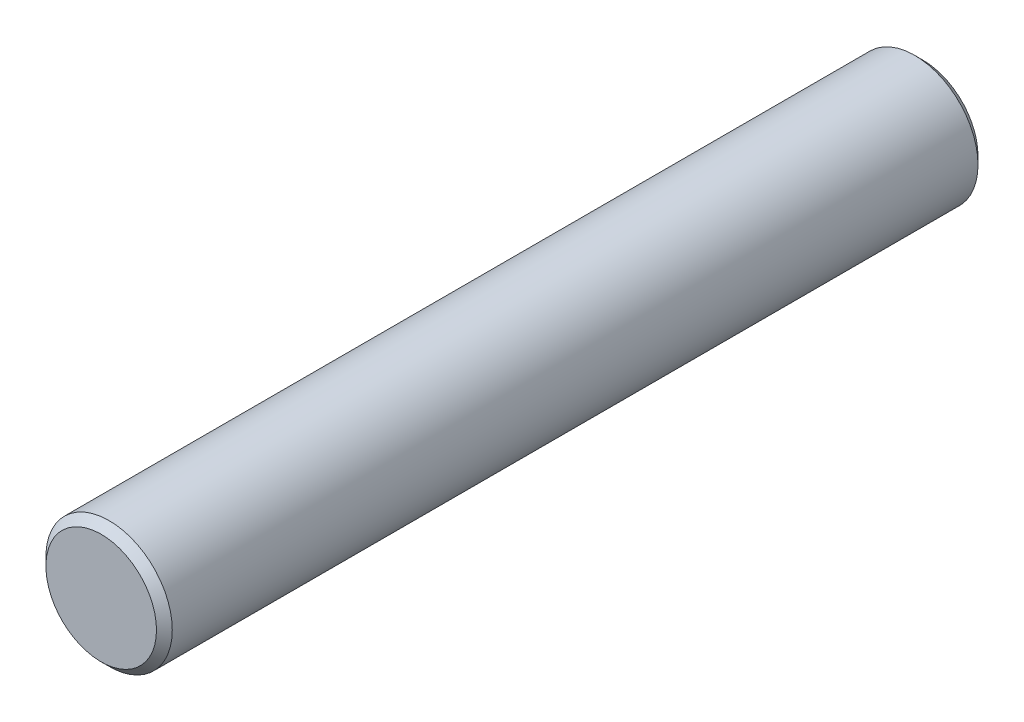
ISO-10303-21;
HEADER;
FILE_DESCRIPTION(('STEP AP214'),'2;1');
FILE_NAME('part.step','',(''),(''),'','','');
FILE_SCHEMA(('AUTOMOTIVE_DESIGN { 1 0 10303 214 1 1 1 1 }'));
ENDSEC;
DATA;
#1=APPLICATION_CONTEXT('core data for automotive mechanical design processes');
#2=APPLICATION_PROTOCOL_DEFINITION('international standard','automotive_design',2000,#1);
#3=PRODUCT_CONTEXT('',#1,'mechanical');
#4=PRODUCT('Part','Part','',(#3));
#5=PRODUCT_RELATED_PRODUCT_CATEGORY('part','',(#4));
#6=PRODUCT_DEFINITION_FORMATION('','',#4);
#7=PRODUCT_DEFINITION_CONTEXT('part definition',#1,'design');
#8=PRODUCT_DEFINITION('design','',#6,#7);
#9=PRODUCT_DEFINITION_SHAPE('','',#8);
#10=(LENGTH_UNIT() NAMED_UNIT(*) SI_UNIT(.MILLI.,.METRE.));
#11=(NAMED_UNIT(*) PLANE_ANGLE_UNIT() SI_UNIT($,.RADIAN.));
#12=(NAMED_UNIT(*) SI_UNIT($,.STERADIAN.) SOLID_ANGLE_UNIT());
#13=UNCERTAINTY_MEASURE_WITH_UNIT(LENGTH_MEASURE(1.E-05),#10,'distance_accuracy_value','');
#14=(GEOMETRIC_REPRESENTATION_CONTEXT(3) GLOBAL_UNCERTAINTY_ASSIGNED_CONTEXT((#13)) GLOBAL_UNIT_ASSIGNED_CONTEXT((#10,
#11,#12)) REPRESENTATION_CONTEXT('',''));
#15=CARTESIAN_POINT('',(0.,0.,0.));
#16=DIRECTION('',(0.,0.,1.));
#17=DIRECTION('',(1.,0.,0.));
#18=AXIS2_PLACEMENT_3D('',#15,#16,#17);
#19=CARTESIAN_POINT('',(0.,0.,52.));
#20=DIRECTION('',(0.,0.,-1.));
#21=DIRECTION('',(-1.,0.,0.));
#22=AXIS2_PLACEMENT_3D('',#19,#20,#21);
#23=CYLINDRICAL_SURFACE('',#22,4.);
#24=CARTESIAN_POINT('',(0.,0.,51.5));
#25=DIRECTION('',(0.,0.,1.));
#26=DIRECTION('',(1.,0.,0.));
#27=AXIS2_PLACEMENT_3D('',#24,#25,#26);
#28=CIRCLE('',#27,4.);
#29=CARTESIAN_POINT('',(4.,0.,51.5));
#30=VERTEX_POINT('',#29);
#31=EDGE_CURVE('E53',#30,#30,#28,.F.);
#32=ORIENTED_EDGE('',*,*,#31,.T.);
#33=EDGE_LOOP('',(#32));
#34=FACE_BOUND('',#33,.T.);
#35=CARTESIAN_POINT('',(0.,0.,0.500000000000021));
#36=DIRECTION('',(0.,0.,1.));
#37=DIRECTION('',(1.,0.,0.));
#38=AXIS2_PLACEMENT_3D('',#35,#36,#37);
#39=CIRCLE('',#38,4.);
#40=CARTESIAN_POINT('',(4.,0.,0.500000000000021));
#41=VERTEX_POINT('',#40);
#42=EDGE_CURVE('E57',#41,#41,#39,.T.);
#43=ORIENTED_EDGE('',*,*,#42,.T.);
#44=EDGE_LOOP('',(#43));
#45=FACE_BOUND('',#44,.T.);
#46=ADVANCED_FACE('F46',(#34,#45),#23,.T.);
#47=CARTESIAN_POINT('',(0.,0.,52.));
#48=DIRECTION('',(0.,0.,1.));
#49=DIRECTION('',(1.,0.,0.));
#50=AXIS2_PLACEMENT_3D('',#47,#48,#49);
#51=PLANE('',#50);
#52=CARTESIAN_POINT('',(0.,0.,52.));
#53=DIRECTION('',(0.,0.,1.));
#54=DIRECTION('',(1.,0.,0.));
#55=AXIS2_PLACEMENT_3D('',#52,#53,#54);
#56=CIRCLE('',#55,3.50000000000003);
#57=CARTESIAN_POINT('',(3.50000000000003,0.,52.));
#58=VERTEX_POINT('',#57);
#59=EDGE_CURVE('E61',#58,#58,#56,.T.);
#60=ORIENTED_EDGE('',*,*,#59,.T.);
#61=EDGE_LOOP('',(#60));
#62=FACE_BOUND('',#61,.T.);
#63=ADVANCED_FACE('F67',(#62),#51,.T.);
#64=CARTESIAN_POINT('',(0.,0.,0.));
#65=DIRECTION('',(0.,0.,1.));
#66=DIRECTION('',(1.,0.,0.));
#67=AXIS2_PLACEMENT_3D('',#64,#65,#66);
#68=PLANE('',#67);
#69=CARTESIAN_POINT('',(0.,0.,0.));
#70=DIRECTION('',(0.,0.,1.));
#71=DIRECTION('',(1.,0.,0.));
#72=AXIS2_PLACEMENT_3D('',#69,#70,#71);
#73=CIRCLE('',#72,3.49999999999997);
#74=CARTESIAN_POINT('',(3.49999999999997,0.,0.));
#75=VERTEX_POINT('',#74);
#76=EDGE_CURVE('E12',#75,#75,#73,.F.);
#77=ORIENTED_EDGE('',*,*,#76,.T.);
#78=EDGE_LOOP('',(#77));
#79=FACE_BOUND('',#78,.T.);
#80=ADVANCED_FACE('F71',(#79),#68,.F.);
#81=CARTESIAN_POINT('',(0.,0.,52.));
#82=DIRECTION('',(0.,0.,-1.));
#83=DIRECTION('',(-1.,0.,0.));
#84=AXIS2_PLACEMENT_3D('',#81,#82,#83);
#85=CONICAL_SURFACE('',#84,3.50000000000003,0.785398163397446);
#86=ORIENTED_EDGE('',*,*,#31,.F.);
#87=EDGE_LOOP('',(#86));
#88=FACE_BOUND('',#87,.T.);
#89=ORIENTED_EDGE('',*,*,#59,.F.);
#90=EDGE_LOOP('',(#89));
#91=FACE_BOUND('',#90,.T.);
#92=ADVANCED_FACE('F69',(#88,#91),#85,.T.);
#93=CARTESIAN_POINT('',(0.,0.,0.500000000000021));
#94=DIRECTION('',(0.,0.,1.));
#95=DIRECTION('',(1.,0.,0.));
#96=AXIS2_PLACEMENT_3D('',#93,#94,#95);
#97=CONICAL_SURFACE('',#96,4.,0.785398163397453);
#98=ORIENTED_EDGE('',*,*,#76,.F.);
#99=EDGE_LOOP('',(#98));
#100=FACE_BOUND('',#99,.T.);
#101=ORIENTED_EDGE('',*,*,#42,.F.);
#102=EDGE_LOOP('',(#101));
#103=FACE_BOUND('',#102,.T.);
#104=ADVANCED_FACE('F48',(#100,#103),#97,.T.);
#105=CLOSED_SHELL('',(#46,#63,#80,#92,#104));
#106=MANIFOLD_SOLID_BREP('B2',#105);
#107=ADVANCED_BREP_SHAPE_REPRESENTATION('',(#18,#106),#14);
#108=SHAPE_DEFINITION_REPRESENTATION(#9,#107);
ENDSEC;
END-ISO-10303-21;
